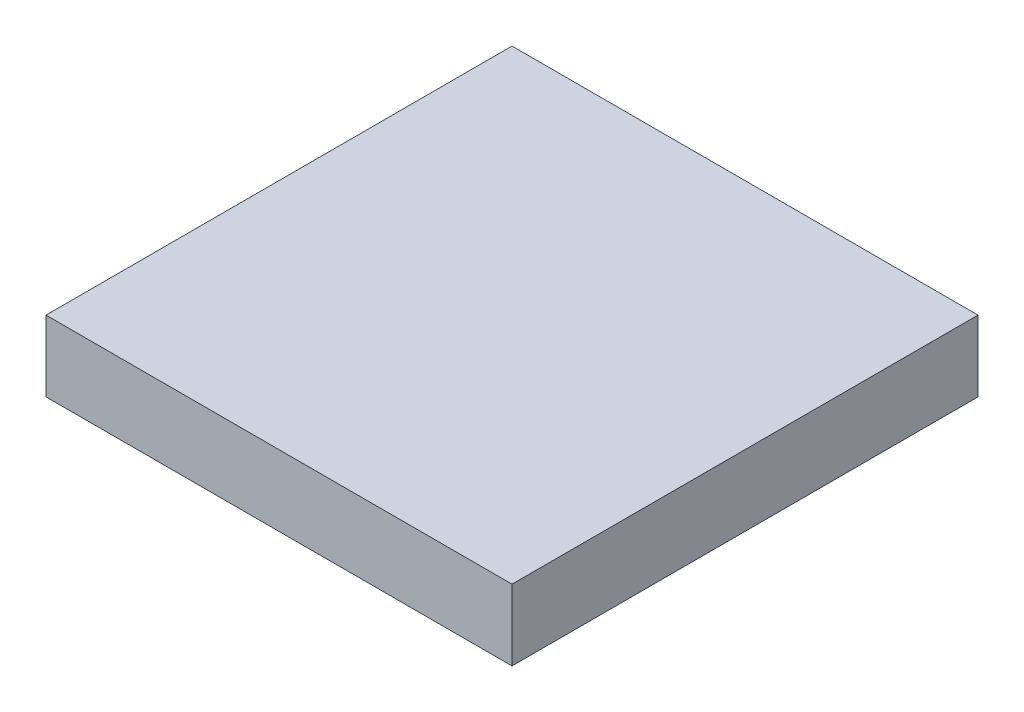
ISO-10303-21;
HEADER;
FILE_DESCRIPTION(('STEP AP214'),'2;1');
FILE_NAME('part.step','',(''),(''),'','','');
FILE_SCHEMA(('AUTOMOTIVE_DESIGN { 1 0 10303 214 1 1 1 1 }'));
ENDSEC;
DATA;
#1=APPLICATION_CONTEXT('core data for automotive mechanical design processes');
#2=APPLICATION_PROTOCOL_DEFINITION('international standard','automotive_design',2000,#1);
#3=PRODUCT_CONTEXT('',#1,'mechanical');
#4=PRODUCT('Part','Part','',(#3));
#5=PRODUCT_RELATED_PRODUCT_CATEGORY('part','',(#4));
#6=PRODUCT_DEFINITION_FORMATION('','',#4);
#7=PRODUCT_DEFINITION_CONTEXT('part definition',#1,'design');
#8=PRODUCT_DEFINITION('design','',#6,#7);
#9=PRODUCT_DEFINITION_SHAPE('','',#8);
#10=(LENGTH_UNIT() NAMED_UNIT(*) SI_UNIT(.MILLI.,.METRE.));
#11=(NAMED_UNIT(*) PLANE_ANGLE_UNIT() SI_UNIT($,.RADIAN.));
#12=(NAMED_UNIT(*) SI_UNIT($,.STERADIAN.) SOLID_ANGLE_UNIT());
#13=UNCERTAINTY_MEASURE_WITH_UNIT(LENGTH_MEASURE(1.E-05),#10,'distance_accuracy_value','');
#14=(GEOMETRIC_REPRESENTATION_CONTEXT(3) GLOBAL_UNCERTAINTY_ASSIGNED_CONTEXT((#13)) GLOBAL_UNIT_ASSIGNED_CONTEXT((#10,
#11,#12)) REPRESENTATION_CONTEXT('',''));
#15=CARTESIAN_POINT('',(0.,0.,0.));
#16=DIRECTION('',(0.,0.,1.));
#17=DIRECTION('',(1.,0.,0.));
#18=AXIS2_PLACEMENT_3D('',#15,#16,#17);
#19=CARTESIAN_POINT('',(4.99999999999997,1.52,-5.));
#20=DIRECTION('',(-1.,0.,0.));
#21=DIRECTION('',(0.,0.,1.));
#22=AXIS2_PLACEMENT_3D('',#19,#20,#21);
#23=PLANE('',#22);
#24=DIRECTION('',(0.,0.,-1.));
#25=VECTOR('',#24,1.);
#26=CARTESIAN_POINT('',(4.99999999999997,0.,-5.));
#27=LINE('',#26,#25);
#28=CARTESIAN_POINT('',(4.99999999999998,0.,5.));
#29=VERTEX_POINT('',#28);
#30=CARTESIAN_POINT('',(4.99999999999997,0.,-5.));
#31=VERTEX_POINT('',#30);
#32=EDGE_CURVE('E99',#29,#31,#27,.T.);
#33=ORIENTED_EDGE('',*,*,#32,.T.);
#34=DIRECTION('',(0.,-1.,0.));
#35=VECTOR('',#34,1.);
#36=CARTESIAN_POINT('',(4.99999999999997,1.52,-5.));
#37=LINE('',#36,#35);
#38=CARTESIAN_POINT('',(4.99999999999997,1.52,-5.));
#39=VERTEX_POINT('',#38);
#40=EDGE_CURVE('E11',#39,#31,#37,.T.);
#41=ORIENTED_EDGE('',*,*,#40,.F.);
#42=DIRECTION('',(0.,0.,-1.));
#43=VECTOR('',#42,1.);
#44=CARTESIAN_POINT('',(4.99999999999997,1.52,-5.));
#45=LINE('',#44,#43);
#46=CARTESIAN_POINT('',(4.99999999999998,1.52,5.));
#47=VERTEX_POINT('',#46);
#48=EDGE_CURVE('E87',#47,#39,#45,.T.);
#49=ORIENTED_EDGE('',*,*,#48,.F.);
#50=DIRECTION('',(0.,-1.,0.));
#51=VECTOR('',#50,1.);
#52=CARTESIAN_POINT('',(4.99999999999998,1.52,5.));
#53=LINE('',#52,#51);
#54=EDGE_CURVE('E95',#47,#29,#53,.T.);
#55=ORIENTED_EDGE('',*,*,#54,.T.);
#56=EDGE_LOOP('',(#33,#41,#49,#55));
#57=FACE_BOUND('',#56,.T.);
#58=ADVANCED_FACE('F36',(#57),#23,.F.);
#59=CARTESIAN_POINT('',(-5.00000000000001,1.52,-5.));
#60=DIRECTION('',(0.,0.,1.));
#61=DIRECTION('',(1.,0.,0.));
#62=AXIS2_PLACEMENT_3D('',#59,#60,#61);
#63=PLANE('',#62);
#64=DIRECTION('',(-1.,0.,0.));
#65=VECTOR('',#64,1.);
#66=CARTESIAN_POINT('',(-5.00000000000001,0.,-5.));
#67=LINE('',#66,#65);
#68=CARTESIAN_POINT('',(-5.00000000000001,0.,-5.));
#69=VERTEX_POINT('',#68);
#70=EDGE_CURVE('E91',#31,#69,#67,.T.);
#71=ORIENTED_EDGE('',*,*,#70,.T.);
#72=DIRECTION('',(0.,-1.,0.));
#73=VECTOR('',#72,1.);
#74=CARTESIAN_POINT('',(-5.00000000000001,1.52,-5.));
#75=LINE('',#74,#73);
#76=CARTESIAN_POINT('',(-5.00000000000001,1.52,-5.));
#77=VERTEX_POINT('',#76);
#78=EDGE_CURVE('E44',#77,#69,#75,.T.);
#79=ORIENTED_EDGE('',*,*,#78,.F.);
#80=DIRECTION('',(-1.,0.,0.));
#81=VECTOR('',#80,1.);
#82=CARTESIAN_POINT('',(-5.00000000000001,1.52,-5.));
#83=LINE('',#82,#81);
#84=EDGE_CURVE('E82',#39,#77,#83,.T.);
#85=ORIENTED_EDGE('',*,*,#84,.F.);
#86=ORIENTED_EDGE('',*,*,#40,.T.);
#87=EDGE_LOOP('',(#71,#79,#85,#86));
#88=FACE_BOUND('',#87,.T.);
#89=ADVANCED_FACE('F90',(#88),#63,.F.);
#90=CARTESIAN_POINT('',(-5.00000000000001,1.52,-5.));
#91=DIRECTION('',(1.,0.,0.));
#92=DIRECTION('',(0.,0.,-1.));
#93=AXIS2_PLACEMENT_3D('',#90,#91,#92);
#94=PLANE('',#93);
#95=DIRECTION('',(0.,0.,1.));
#96=VECTOR('',#95,1.);
#97=CARTESIAN_POINT('',(-5.00000000000001,0.,-5.));
#98=LINE('',#97,#96);
#99=CARTESIAN_POINT('',(-5.00000000000001,0.,5.));
#100=VERTEX_POINT('',#99);
#101=EDGE_CURVE('E69',#69,#100,#98,.T.);
#102=ORIENTED_EDGE('',*,*,#101,.T.);
#103=DIRECTION('',(0.,-1.,0.));
#104=VECTOR('',#103,1.);
#105=CARTESIAN_POINT('',(-5.00000000000001,1.52,5.));
#106=LINE('',#105,#104);
#107=CARTESIAN_POINT('',(-5.00000000000001,1.52,5.));
#108=VERTEX_POINT('',#107);
#109=EDGE_CURVE('E92',#108,#100,#106,.T.);
#110=ORIENTED_EDGE('',*,*,#109,.F.);
#111=DIRECTION('',(0.,0.,1.));
#112=VECTOR('',#111,1.);
#113=CARTESIAN_POINT('',(-5.00000000000001,1.52,-5.));
#114=LINE('',#113,#112);
#115=EDGE_CURVE('E85',#77,#108,#114,.T.);
#116=ORIENTED_EDGE('',*,*,#115,.F.);
#117=ORIENTED_EDGE('',*,*,#78,.T.);
#118=EDGE_LOOP('',(#102,#110,#116,#117));
#119=FACE_BOUND('',#118,.T.);
#120=ADVANCED_FACE('F93',(#119),#94,.F.);
#121=CARTESIAN_POINT('',(-5.00000000000001,1.52,5.));
#122=DIRECTION('',(0.,0.,-1.));
#123=DIRECTION('',(-1.,0.,0.));
#124=AXIS2_PLACEMENT_3D('',#121,#122,#123);
#125=PLANE('',#124);
#126=DIRECTION('',(1.,0.,0.));
#127=VECTOR('',#126,1.);
#128=CARTESIAN_POINT('',(-5.00000000000001,0.,5.));
#129=LINE('',#128,#127);
#130=EDGE_CURVE('E75',#100,#29,#129,.T.);
#131=ORIENTED_EDGE('',*,*,#130,.T.);
#132=ORIENTED_EDGE('',*,*,#54,.F.);
#133=DIRECTION('',(1.,0.,0.));
#134=VECTOR('',#133,1.);
#135=CARTESIAN_POINT('',(-5.00000000000001,1.52,5.));
#136=LINE('',#135,#134);
#137=EDGE_CURVE('E52',#108,#47,#136,.T.);
#138=ORIENTED_EDGE('',*,*,#137,.F.);
#139=ORIENTED_EDGE('',*,*,#109,.T.);
#140=EDGE_LOOP('',(#131,#132,#138,#139));
#141=FACE_BOUND('',#140,.T.);
#142=ADVANCED_FACE('F106',(#141),#125,.F.);
#143=CARTESIAN_POINT('',(0.,1.52,0.));
#144=DIRECTION('',(0.,1.,0.));
#145=DIRECTION('',(0.,0.,1.));
#146=AXIS2_PLACEMENT_3D('',#143,#144,#145);
#147=PLANE('',#146);
#148=ORIENTED_EDGE('',*,*,#48,.T.);
#149=ORIENTED_EDGE('',*,*,#84,.T.);
#150=ORIENTED_EDGE('',*,*,#115,.T.);
#151=ORIENTED_EDGE('',*,*,#137,.T.);
#152=EDGE_LOOP('',(#148,#149,#150,#151));
#153=FACE_BOUND('',#152,.T.);
#154=ADVANCED_FACE('F83',(#153),#147,.T.);
#155=CARTESIAN_POINT('',(0.,0.,0.));
#156=DIRECTION('',(0.,1.,0.));
#157=DIRECTION('',(0.,0.,1.));
#158=AXIS2_PLACEMENT_3D('',#155,#156,#157);
#159=PLANE('',#158);
#160=ORIENTED_EDGE('',*,*,#32,.F.);
#161=ORIENTED_EDGE('',*,*,#130,.F.);
#162=ORIENTED_EDGE('',*,*,#101,.F.);
#163=ORIENTED_EDGE('',*,*,#70,.F.);
#164=EDGE_LOOP('',(#160,#161,#162,#163));
#165=FACE_BOUND('',#164,.T.);
#166=ADVANCED_FACE('F109',(#165),#159,.F.);
#167=CLOSED_SHELL('',(#58,#89,#120,#142,#154,#166));
#168=MANIFOLD_SOLID_BREP('B2',#167);
#169=ADVANCED_BREP_SHAPE_REPRESENTATION('',(#18,#168),#14);
#170=SHAPE_DEFINITION_REPRESENTATION(#9,#169);
ENDSEC;
END-ISO-10303-21;
